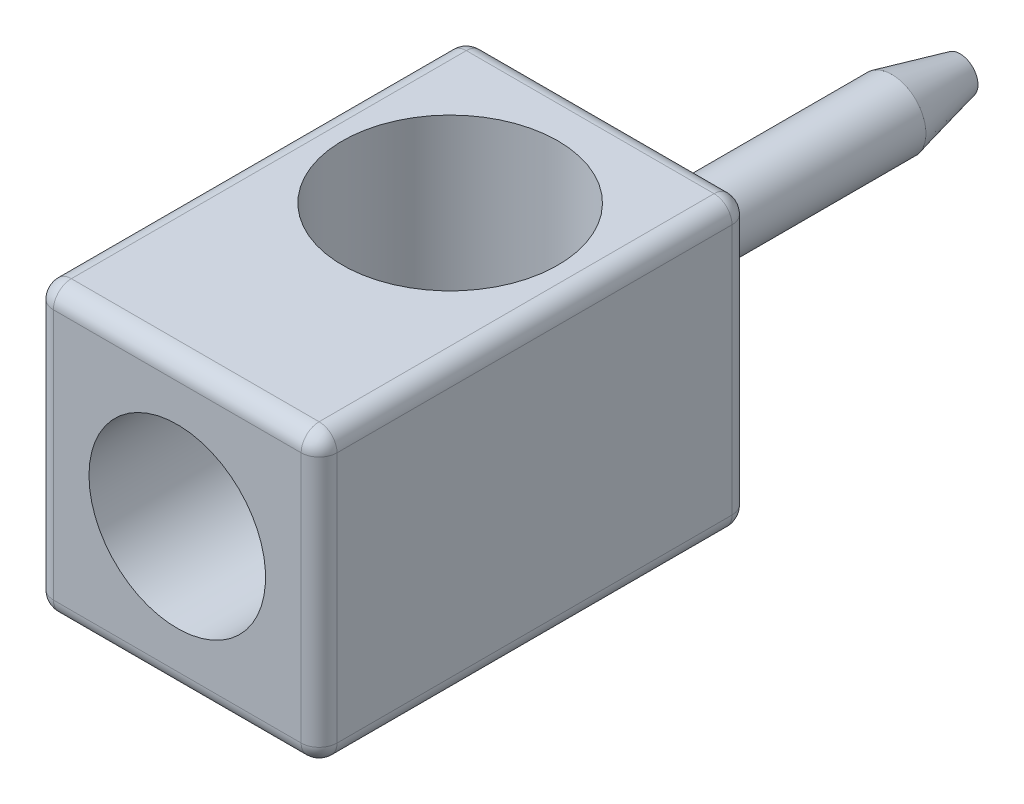
ISO-10303-21;
HEADER;
FILE_DESCRIPTION(('STEP AP214'),'2;1');
FILE_NAME('part.step','',(''),(''),'','','');
FILE_SCHEMA(('AUTOMOTIVE_DESIGN { 1 0 10303 214 1 1 1 1 }'));
ENDSEC;
DATA;
#1=APPLICATION_CONTEXT('core data for automotive mechanical design processes');
#2=APPLICATION_PROTOCOL_DEFINITION('international standard','automotive_design',2000,#1);
#3=PRODUCT_CONTEXT('',#1,'mechanical');
#4=PRODUCT('Part','Part','',(#3));
#5=PRODUCT_RELATED_PRODUCT_CATEGORY('part','',(#4));
#6=PRODUCT_DEFINITION_FORMATION('','',#4);
#7=PRODUCT_DEFINITION_CONTEXT('part definition',#1,'design');
#8=PRODUCT_DEFINITION('design','',#6,#7);
#9=PRODUCT_DEFINITION_SHAPE('','',#8);
#10=(LENGTH_UNIT() NAMED_UNIT(*) SI_UNIT(.MILLI.,.METRE.));
#11=(NAMED_UNIT(*) PLANE_ANGLE_UNIT() SI_UNIT($,.RADIAN.));
#12=(NAMED_UNIT(*) SI_UNIT($,.STERADIAN.) SOLID_ANGLE_UNIT());
#13=UNCERTAINTY_MEASURE_WITH_UNIT(LENGTH_MEASURE(1.E-05),#10,'distance_accuracy_value','');
#14=(GEOMETRIC_REPRESENTATION_CONTEXT(3) GLOBAL_UNCERTAINTY_ASSIGNED_CONTEXT((#13)) GLOBAL_UNIT_ASSIGNED_CONTEXT((#10,
#11,#12)) REPRESENTATION_CONTEXT('',''));
#15=CARTESIAN_POINT('',(0.,0.,0.));
#16=DIRECTION('',(0.,0.,1.));
#17=DIRECTION('',(1.,0.,0.));
#18=AXIS2_PLACEMENT_3D('',#15,#16,#17);
#19=CARTESIAN_POINT('',(0.,0.,-7.9));
#20=DIRECTION('',(0.,0.,1.));
#21=DIRECTION('',(1.,0.,0.));
#22=AXIS2_PLACEMENT_3D('',#19,#20,#21);
#23=PLANE('',#22);
#24=CARTESIAN_POINT('',(0.,0.,-7.90000000000646));
#25=DIRECTION('',(0.,0.,1.));
#26=DIRECTION('',(1.,0.,0.));
#27=AXIS2_PLACEMENT_3D('',#24,#25,#26);
#28=CIRCLE('',#27,0.249999999979877);
#29=CARTESIAN_POINT('',(0.249999999979877,0.,-7.90000000000646));
#30=VERTEX_POINT('',#29);
#31=EDGE_CURVE('E20',#30,#30,#28,.T.);
#32=ORIENTED_EDGE('',*,*,#31,.F.);
#33=EDGE_LOOP('',(#32));
#34=FACE_BOUND('',#33,.T.);
#35=ADVANCED_FACE('F17',(#34),#23,.F.);
#36=CARTESIAN_POINT('',(0.,0.,-6.94999999996071));
#37=DIRECTION('',(0.,0.,1.));
#38=DIRECTION('',(1.,0.,0.));
#39=AXIS2_PLACEMENT_3D('',#36,#37,#38);
#40=CONICAL_SURFACE('',#39,0.474999999994452,0.232556941808636);
#41=CARTESIAN_POINT('',(0.,0.,-6.95));
#42=DIRECTION('',(0.,0.,-1.));
#43=DIRECTION('',(-1.,0.,0.));
#44=AXIS2_PLACEMENT_3D('',#41,#42,#43);
#45=CIRCLE('',#44,0.475);
#46=CARTESIAN_POINT('',(-0.475000000000001,0.,-6.95));
#47=VERTEX_POINT('',#46);
#48=EDGE_CURVE('E217',#47,#47,#45,.F.);
#49=ORIENTED_EDGE('',*,*,#48,.F.);
#50=EDGE_LOOP('',(#49));
#51=FACE_BOUND('',#50,.T.);
#52=ORIENTED_EDGE('',*,*,#31,.T.);
#53=EDGE_LOOP('',(#52));
#54=FACE_BOUND('',#53,.T.);
#55=ADVANCED_FACE('F235',(#51,#54),#40,.T.);
#56=CARTESIAN_POINT('',(0.,0.,-7.9));
#57=DIRECTION('',(0.,0.,-1.));
#58=DIRECTION('',(-1.,0.,0.));
#59=AXIS2_PLACEMENT_3D('',#56,#57,#58);
#60=CYLINDRICAL_SURFACE('',#59,0.475);
#61=CARTESIAN_POINT('',(0.,0.,-3.));
#62=DIRECTION('',(0.,0.,-1.));
#63=DIRECTION('',(-1.,0.,0.));
#64=AXIS2_PLACEMENT_3D('',#61,#62,#63);
#65=CIRCLE('',#64,0.475);
#66=CARTESIAN_POINT('',(-0.475000000000001,0.,-3.));
#67=VERTEX_POINT('',#66);
#68=EDGE_CURVE('E195',#67,#67,#65,.T.);
#69=ORIENTED_EDGE('',*,*,#68,.T.);
#70=EDGE_LOOP('',(#69));
#71=FACE_BOUND('',#70,.T.);
#72=ORIENTED_EDGE('',*,*,#48,.T.);
#73=EDGE_LOOP('',(#72));
#74=FACE_BOUND('',#73,.T.);
#75=ADVANCED_FACE('F232',(#71,#74),#60,.T.);
#76=CARTESIAN_POINT('',(1.725,-2.,-2.75));
#77=DIRECTION('',(0.,-1.,0.));
#78=DIRECTION('',(0.,0.,-1.));
#79=AXIS2_PLACEMENT_3D('',#76,#77,#78);
#80=CYLINDRICAL_SURFACE('',#79,0.25);
#81=CARTESIAN_POINT('',(1.725,1.75,-2.75));
#82=DIRECTION('',(0.,1.,-6.13305568504924E-12));
#83=DIRECTION('',(1.,0.,0.));
#84=AXIS2_PLACEMENT_3D('',#81,#82,#83);
#85=CIRCLE('',#84,0.25);
#86=CARTESIAN_POINT('',(1.975,1.75,-2.75));
#87=VERTEX_POINT('',#86);
#88=CARTESIAN_POINT('',(1.725,1.74999999999962,-3.));
#89=VERTEX_POINT('',#88);
#90=EDGE_CURVE('E216',#87,#89,#85,.T.);
#91=ORIENTED_EDGE('',*,*,#90,.F.);
#92=DIRECTION('',(0.,1.,0.));
#93=VECTOR('',#92,1.);
#94=CARTESIAN_POINT('',(1.975,-2.,-2.75));
#95=LINE('',#94,#93);
#96=CARTESIAN_POINT('',(1.975,-1.75,-2.75));
#97=VERTEX_POINT('',#96);
#98=EDGE_CURVE('E105',#87,#97,#95,.F.);
#99=ORIENTED_EDGE('',*,*,#98,.T.);
#100=CARTESIAN_POINT('',(1.725,-1.75,-2.75));
#101=DIRECTION('',(0.,1.,0.));
#102=DIRECTION('',(1.,0.,0.));
#103=AXIS2_PLACEMENT_3D('',#100,#101,#102);
#104=CIRCLE('',#103,0.25);
#105=CARTESIAN_POINT('',(1.725,-1.75,-3.));
#106=VERTEX_POINT('',#105);
#107=EDGE_CURVE('E193',#106,#97,#104,.F.);
#108=ORIENTED_EDGE('',*,*,#107,.F.);
#109=DIRECTION('',(0.,1.,0.));
#110=VECTOR('',#109,1.);
#111=CARTESIAN_POINT('',(1.725,-2.,-3.));
#112=LINE('',#111,#110);
#113=EDGE_CURVE('E192',#106,#89,#112,.T.);
#114=ORIENTED_EDGE('',*,*,#113,.T.);
#115=EDGE_LOOP('',(#91,#99,#108,#114));
#116=FACE_BOUND('',#115,.T.);
#117=ADVANCED_FACE('F228',(#116),#80,.T.);
#118=CARTESIAN_POINT('',(-1.725,2.,-2.75));
#119=DIRECTION('',(0.,1.,0.));
#120=DIRECTION('',(0.,0.,1.));
#121=AXIS2_PLACEMENT_3D('',#118,#119,#120);
#122=CYLINDRICAL_SURFACE('',#121,0.25);
#123=CARTESIAN_POINT('',(-1.725,1.75,-2.75));
#124=DIRECTION('',(0.,1.,0.));
#125=DIRECTION('',(1.,0.,0.));
#126=AXIS2_PLACEMENT_3D('',#123,#124,#125);
#127=CIRCLE('',#126,0.25);
#128=CARTESIAN_POINT('',(-1.725,1.75,-3.));
#129=VERTEX_POINT('',#128);
#130=CARTESIAN_POINT('',(-1.975,1.75,-2.75));
#131=VERTEX_POINT('',#130);
#132=EDGE_CURVE('E123',#129,#131,#127,.T.);
#133=ORIENTED_EDGE('',*,*,#132,.F.);
#134=DIRECTION('',(0.,1.,0.));
#135=VECTOR('',#134,1.);
#136=CARTESIAN_POINT('',(-1.725,-2.,-3.));
#137=LINE('',#136,#135);
#138=CARTESIAN_POINT('',(-1.725,-1.75000000000038,-3.));
#139=VERTEX_POINT('',#138);
#140=EDGE_CURVE('E422',#129,#139,#137,.F.);
#141=ORIENTED_EDGE('',*,*,#140,.T.);
#142=CARTESIAN_POINT('',(-1.725,-1.75,-2.75));
#143=DIRECTION('',(0.,1.,-6.13305568504924E-12));
#144=DIRECTION('',(1.,0.,0.));
#145=AXIS2_PLACEMENT_3D('',#142,#143,#144);
#146=CIRCLE('',#145,0.25);
#147=CARTESIAN_POINT('',(-1.975,-1.75,-2.75));
#148=VERTEX_POINT('',#147);
#149=EDGE_CURVE('E171',#148,#139,#146,.F.);
#150=ORIENTED_EDGE('',*,*,#149,.F.);
#151=DIRECTION('',(0.,1.,0.));
#152=VECTOR('',#151,1.);
#153=CARTESIAN_POINT('',(-1.975,2.,-2.75));
#154=LINE('',#153,#152);
#155=EDGE_CURVE('E168',#148,#131,#154,.T.);
#156=ORIENTED_EDGE('',*,*,#155,.T.);
#157=EDGE_LOOP('',(#133,#141,#150,#156));
#158=FACE_BOUND('',#157,.T.);
#159=ADVANCED_FACE('F225',(#158),#122,.T.);
#160=CARTESIAN_POINT('',(1.725,1.75,2.75));
#161=DIRECTION('',(1.,0.,0.));
#162=DIRECTION('',(0.,1.,0.));
#163=AXIS2_PLACEMENT_3D('',#160,#161,#162);
#164=SPHERICAL_SURFACE('',#163,0.25);
#165=CARTESIAN_POINT('',(1.725,1.75,2.75));
#166=DIRECTION('',(0.,0.,1.));
#167=DIRECTION('',(1.,0.,0.));
#168=AXIS2_PLACEMENT_3D('',#165,#166,#167);
#169=CIRCLE('',#168,0.25);
#170=CARTESIAN_POINT('',(1.725,2.,2.75));
#171=VERTEX_POINT('',#170);
#172=CARTESIAN_POINT('',(1.975,1.75,2.75));
#173=VERTEX_POINT('',#172);
#174=EDGE_CURVE('E114',#171,#173,#169,.F.);
#175=ORIENTED_EDGE('',*,*,#174,.F.);
#176=CARTESIAN_POINT('',(1.725,1.75,2.75));
#177=DIRECTION('',(-1.,0.,0.));
#178=DIRECTION('',(0.,0.,1.));
#179=AXIS2_PLACEMENT_3D('',#176,#177,#178);
#180=CIRCLE('',#179,0.25);
#181=CARTESIAN_POINT('',(1.725,1.75,3.));
#182=VERTEX_POINT('',#181);
#183=EDGE_CURVE('E116',#182,#171,#180,.T.);
#184=ORIENTED_EDGE('',*,*,#183,.F.);
#185=CARTESIAN_POINT('',(1.725,1.75,2.75));
#186=DIRECTION('',(0.,1.,0.));
#187=DIRECTION('',(0.,0.,1.));
#188=AXIS2_PLACEMENT_3D('',#185,#186,#187);
#189=CIRCLE('',#188,0.25);
#190=EDGE_CURVE('E111',#173,#182,#189,.F.);
#191=ORIENTED_EDGE('',*,*,#190,.F.);
#192=EDGE_LOOP('',(#175,#184,#191));
#193=FACE_BOUND('',#192,.T.);
#194=ADVANCED_FACE('F113',(#193),#164,.T.);
#195=CARTESIAN_POINT('',(-1.725,1.75,2.75));
#196=DIRECTION('',(1.,0.,0.));
#197=DIRECTION('',(0.,1.,0.));
#198=AXIS2_PLACEMENT_3D('',#195,#196,#197);
#199=SPHERICAL_SURFACE('',#198,0.25);
#200=CARTESIAN_POINT('',(-1.725,1.75,2.75));
#201=DIRECTION('',(-1.,0.,0.));
#202=DIRECTION('',(0.,0.,1.));
#203=AXIS2_PLACEMENT_3D('',#200,#201,#202);
#204=CIRCLE('',#203,0.25);
#205=CARTESIAN_POINT('',(-1.725,2.,2.75));
#206=VERTEX_POINT('',#205);
#207=CARTESIAN_POINT('',(-1.725,1.75000000000077,3.));
#208=VERTEX_POINT('',#207);
#209=EDGE_CURVE('E313',#206,#208,#204,.F.);
#210=ORIENTED_EDGE('',*,*,#209,.F.);
#211=CARTESIAN_POINT('',(-1.725,1.75,2.75));
#212=DIRECTION('',(0.,0.,1.));
#213=DIRECTION('',(1.,0.,0.));
#214=AXIS2_PLACEMENT_3D('',#211,#212,#213);
#215=CIRCLE('',#214,0.25);
#216=CARTESIAN_POINT('',(-1.975,1.75,2.75));
#217=VERTEX_POINT('',#216);
#218=EDGE_CURVE('E321',#217,#206,#215,.F.);
#219=ORIENTED_EDGE('',*,*,#218,.F.);
#220=CARTESIAN_POINT('',(-1.725,1.75,2.75));
#221=DIRECTION('',(0.,-1.,0.));
#222=DIRECTION('',(0.,0.,-1.));
#223=AXIS2_PLACEMENT_3D('',#220,#221,#222);
#224=CIRCLE('',#223,0.25);
#225=EDGE_CURVE('E122',#208,#217,#224,.T.);
#226=ORIENTED_EDGE('',*,*,#225,.F.);
#227=EDGE_LOOP('',(#210,#219,#226));
#228=FACE_BOUND('',#227,.T.);
#229=ADVANCED_FACE('F210',(#228),#199,.T.);
#230=CARTESIAN_POINT('',(1.725,1.75,-2.75));
#231=DIRECTION('',(1.,0.,0.));
#232=DIRECTION('',(0.,1.,0.));
#233=AXIS2_PLACEMENT_3D('',#230,#231,#232);
#234=SPHERICAL_SURFACE('',#233,0.25);
#235=ORIENTED_EDGE('',*,*,#90,.T.);
#236=CARTESIAN_POINT('',(1.725,1.75,-2.75));
#237=DIRECTION('',(1.,0.,0.));
#238=DIRECTION('',(0.,0.,-1.));
#239=AXIS2_PLACEMENT_3D('',#236,#237,#238);
#240=CIRCLE('',#239,0.25);
#241=CARTESIAN_POINT('',(1.725,2.,-2.75));
#242=VERTEX_POINT('',#241);
#243=EDGE_CURVE('E345',#242,#89,#240,.F.);
#244=ORIENTED_EDGE('',*,*,#243,.F.);
#245=CARTESIAN_POINT('',(1.725,1.75,-2.75));
#246=DIRECTION('',(0.,0.,1.));
#247=DIRECTION('',(1.,0.,0.));
#248=AXIS2_PLACEMENT_3D('',#245,#246,#247);
#249=CIRCLE('',#248,0.25);
#250=EDGE_CURVE('E141',#87,#242,#249,.T.);
#251=ORIENTED_EDGE('',*,*,#250,.F.);
#252=EDGE_LOOP('',(#235,#244,#251));
#253=FACE_BOUND('',#252,.T.);
#254=ADVANCED_FACE('F206',(#253),#234,.T.);
#255=CARTESIAN_POINT('',(-1.725,1.75,-2.75));
#256=DIRECTION('',(1.,0.,0.));
#257=DIRECTION('',(0.,1.,0.));
#258=AXIS2_PLACEMENT_3D('',#255,#256,#257);
#259=SPHERICAL_SURFACE('',#258,0.25);
#260=ORIENTED_EDGE('',*,*,#132,.T.);
#261=CARTESIAN_POINT('',(-1.725,1.75,-2.75));
#262=DIRECTION('',(0.,0.,1.));
#263=DIRECTION('',(1.,0.,0.));
#264=AXIS2_PLACEMENT_3D('',#261,#262,#263);
#265=CIRCLE('',#264,0.25);
#266=CARTESIAN_POINT('',(-1.725,2.,-2.75));
#267=VERTEX_POINT('',#266);
#268=EDGE_CURVE('E351',#267,#131,#265,.T.);
#269=ORIENTED_EDGE('',*,*,#268,.F.);
#270=CARTESIAN_POINT('',(-1.725,1.75,-2.75));
#271=DIRECTION('',(1.,0.,0.));
#272=DIRECTION('',(0.,0.,-1.));
#273=AXIS2_PLACEMENT_3D('',#270,#271,#272);
#274=CIRCLE('',#273,0.25);
#275=EDGE_CURVE('E340',#129,#267,#274,.T.);
#276=ORIENTED_EDGE('',*,*,#275,.F.);
#277=EDGE_LOOP('',(#260,#269,#276));
#278=FACE_BOUND('',#277,.T.);
#279=ADVANCED_FACE('F202',(#278),#259,.T.);
#280=CARTESIAN_POINT('',(1.725,-2.,2.75));
#281=DIRECTION('',(0.,1.,0.));
#282=DIRECTION('',(0.,0.,1.));
#283=AXIS2_PLACEMENT_3D('',#280,#281,#282);
#284=CYLINDRICAL_SURFACE('',#283,0.25);
#285=ORIENTED_EDGE('',*,*,#190,.T.);
#286=DIRECTION('',(0.,1.,0.));
#287=VECTOR('',#286,1.);
#288=CARTESIAN_POINT('',(1.725,-2.,3.));
#289=LINE('',#288,#287);
#290=CARTESIAN_POINT('',(1.725,-1.74999999999962,3.));
#291=VERTEX_POINT('',#290);
#292=EDGE_CURVE('E327',#291,#182,#289,.T.);
#293=ORIENTED_EDGE('',*,*,#292,.F.);
#294=CARTESIAN_POINT('',(1.725,-1.75,2.75));
#295=DIRECTION('',(0.,-1.,6.13293322036932E-12));
#296=DIRECTION('',(1.,0.,0.));
#297=AXIS2_PLACEMENT_3D('',#294,#295,#296);
#298=CIRCLE('',#297,0.25);
#299=CARTESIAN_POINT('',(1.975,-1.75,2.75));
#300=VERTEX_POINT('',#299);
#301=EDGE_CURVE('E137',#300,#291,#298,.T.);
#302=ORIENTED_EDGE('',*,*,#301,.F.);
#303=DIRECTION('',(0.,1.,0.));
#304=VECTOR('',#303,1.);
#305=CARTESIAN_POINT('',(1.975,-2.,2.75));
#306=LINE('',#305,#304);
#307=EDGE_CURVE('E135',#300,#173,#306,.T.);
#308=ORIENTED_EDGE('',*,*,#307,.T.);
#309=EDGE_LOOP('',(#285,#293,#302,#308));
#310=FACE_BOUND('',#309,.T.);
#311=ADVANCED_FACE('F136',(#310),#284,.T.);
#312=CARTESIAN_POINT('',(-1.725,-2.,2.75));
#313=DIRECTION('',(0.,-1.,0.));
#314=DIRECTION('',(0.,0.,-1.));
#315=AXIS2_PLACEMENT_3D('',#312,#313,#314);
#316=CYLINDRICAL_SURFACE('',#315,0.25);
#317=ORIENTED_EDGE('',*,*,#225,.T.);
#318=DIRECTION('',(0.,1.,0.));
#319=VECTOR('',#318,1.);
#320=CARTESIAN_POINT('',(-1.975,2.,2.75));
#321=LINE('',#320,#319);
#322=CARTESIAN_POINT('',(-1.975,-1.75,2.75));
#323=VERTEX_POINT('',#322);
#324=EDGE_CURVE('E165',#217,#323,#321,.F.);
#325=ORIENTED_EDGE('',*,*,#324,.T.);
#326=CARTESIAN_POINT('',(-1.725,-1.75,2.75));
#327=DIRECTION('',(0.,-1.,0.));
#328=DIRECTION('',(1.,0.,0.));
#329=AXIS2_PLACEMENT_3D('',#326,#327,#328);
#330=CIRCLE('',#329,0.25);
#331=CARTESIAN_POINT('',(-1.725,-1.75,3.));
#332=VERTEX_POINT('',#331);
#333=EDGE_CURVE('E132',#332,#323,#330,.T.);
#334=ORIENTED_EDGE('',*,*,#333,.F.);
#335=DIRECTION('',(0.,1.,0.));
#336=VECTOR('',#335,1.);
#337=CARTESIAN_POINT('',(-1.725,-2.,3.));
#338=LINE('',#337,#336);
#339=EDGE_CURVE('E326',#208,#332,#338,.F.);
#340=ORIENTED_EDGE('',*,*,#339,.F.);
#341=EDGE_LOOP('',(#317,#325,#334,#340));
#342=FACE_BOUND('',#341,.T.);
#343=ADVANCED_FACE('F332',(#342),#316,.T.);
#344=CARTESIAN_POINT('',(1.975,-2.,3.));
#345=DIRECTION('',(-1.,0.,0.));
#346=DIRECTION('',(0.,0.,1.));
#347=AXIS2_PLACEMENT_3D('',#344,#345,#346);
#348=PLANE('',#347);
#349=DIRECTION('',(0.,0.,1.));
#350=VECTOR('',#349,1.);
#351=CARTESIAN_POINT('',(1.975,1.75,3.));
#352=LINE('',#351,#350);
#353=EDGE_CURVE('E128',#173,#87,#352,.F.);
#354=ORIENTED_EDGE('',*,*,#353,.F.);
#355=ORIENTED_EDGE('',*,*,#307,.F.);
#356=DIRECTION('',(0.,0.,1.));
#357=VECTOR('',#356,1.);
#358=CARTESIAN_POINT('',(1.975,-1.75,3.));
#359=LINE('',#358,#357);
#360=EDGE_CURVE('E384',#97,#300,#359,.T.);
#361=ORIENTED_EDGE('',*,*,#360,.F.);
#362=ORIENTED_EDGE('',*,*,#98,.F.);
#363=EDGE_LOOP('',(#354,#355,#361,#362));
#364=FACE_BOUND('',#363,.T.);
#365=ADVANCED_FACE('F140',(#364),#348,.F.);
#366=CARTESIAN_POINT('',(1.725,-1.75,-2.75));
#367=DIRECTION('',(1.,0.,0.));
#368=DIRECTION('',(0.,1.,0.));
#369=AXIS2_PLACEMENT_3D('',#366,#367,#368);
#370=SPHERICAL_SURFACE('',#369,0.25);
#371=CARTESIAN_POINT('',(1.725,-1.75,-2.75));
#372=DIRECTION('',(0.,0.,1.));
#373=DIRECTION('',(1.,0.,0.));
#374=AXIS2_PLACEMENT_3D('',#371,#372,#373);
#375=CIRCLE('',#374,0.25);
#376=CARTESIAN_POINT('',(1.725,-2.,-2.74999999999847));
#377=VERTEX_POINT('',#376);
#378=EDGE_CURVE('E335',#377,#97,#375,.T.);
#379=ORIENTED_EDGE('',*,*,#378,.F.);
#380=CARTESIAN_POINT('',(1.725,-1.75,-2.75));
#381=DIRECTION('',(-1.,0.,0.));
#382=DIRECTION('',(0.,0.,1.));
#383=AXIS2_PLACEMENT_3D('',#380,#381,#382);
#384=CIRCLE('',#383,0.25);
#385=EDGE_CURVE('E382',#106,#377,#384,.T.);
#386=ORIENTED_EDGE('',*,*,#385,.F.);
#387=ORIENTED_EDGE('',*,*,#107,.T.);
#388=EDGE_LOOP('',(#379,#386,#387));
#389=FACE_BOUND('',#388,.T.);
#390=ADVANCED_FACE('F182',(#389),#370,.T.);
#391=CARTESIAN_POINT('',(-1.975,-2.,-3.));
#392=DIRECTION('',(0.,0.,1.));
#393=DIRECTION('',(1.,0.,0.));
#394=AXIS2_PLACEMENT_3D('',#391,#392,#393);
#395=PLANE('',#394);
#396=DIRECTION('',(1.,0.,0.));
#397=VECTOR('',#396,1.);
#398=CARTESIAN_POINT('',(1.975,1.75,-3.));
#399=LINE('',#398,#397);
#400=EDGE_CURVE('E342',#89,#129,#399,.F.);
#401=ORIENTED_EDGE('',*,*,#400,.F.);
#402=ORIENTED_EDGE('',*,*,#113,.F.);
#403=DIRECTION('',(-1.,0.,0.));
#404=VECTOR('',#403,1.);
#405=CARTESIAN_POINT('',(-1.975,-1.75,-3.));
#406=LINE('',#405,#404);
#407=EDGE_CURVE('E376',#139,#106,#406,.F.);
#408=ORIENTED_EDGE('',*,*,#407,.F.);
#409=ORIENTED_EDGE('',*,*,#140,.F.);
#410=EDGE_LOOP('',(#401,#402,#408,#409));
#411=FACE_BOUND('',#410,.T.);
#412=ORIENTED_EDGE('',*,*,#68,.F.);
#413=EDGE_LOOP('',(#412));
#414=FACE_BOUND('',#413,.T.);
#415=ADVANCED_FACE('F178',(#411,#414),#395,.F.);
#416=CARTESIAN_POINT('',(-1.725,-1.75,-2.75));
#417=DIRECTION('',(1.,0.,0.));
#418=DIRECTION('',(0.,1.,0.));
#419=AXIS2_PLACEMENT_3D('',#416,#417,#418);
#420=SPHERICAL_SURFACE('',#419,0.25);
#421=CARTESIAN_POINT('',(-1.725,-1.75,-2.75));
#422=DIRECTION('',(0.,0.,1.));
#423=DIRECTION('',(1.,0.,0.));
#424=AXIS2_PLACEMENT_3D('',#421,#422,#423);
#425=CIRCLE('',#424,0.25);
#426=CARTESIAN_POINT('',(-1.725,-2.,-2.75));
#427=VERTEX_POINT('',#426);
#428=EDGE_CURVE('E371',#148,#427,#425,.T.);
#429=ORIENTED_EDGE('',*,*,#428,.F.);
#430=ORIENTED_EDGE('',*,*,#149,.T.);
#431=CARTESIAN_POINT('',(-1.725,-1.75,-2.75));
#432=DIRECTION('',(-1.,0.,0.));
#433=DIRECTION('',(0.,0.,1.));
#434=AXIS2_PLACEMENT_3D('',#431,#432,#433);
#435=CIRCLE('',#434,0.25);
#436=EDGE_CURVE('E379',#427,#139,#435,.F.);
#437=ORIENTED_EDGE('',*,*,#436,.F.);
#438=EDGE_LOOP('',(#429,#430,#437));
#439=FACE_BOUND('',#438,.T.);
#440=ADVANCED_FACE('F175',(#439),#420,.T.);
#441=CARTESIAN_POINT('',(-1.975,2.,3.));
#442=DIRECTION('',(1.,0.,0.));
#443=DIRECTION('',(0.,0.,-1.));
#444=AXIS2_PLACEMENT_3D('',#441,#442,#443);
#445=PLANE('',#444);
#446=DIRECTION('',(0.,0.,1.));
#447=VECTOR('',#446,1.);
#448=CARTESIAN_POINT('',(-1.975,1.75,3.));
#449=LINE('',#448,#447);
#450=EDGE_CURVE('E348',#131,#217,#449,.T.);
#451=ORIENTED_EDGE('',*,*,#450,.F.);
#452=ORIENTED_EDGE('',*,*,#155,.F.);
#453=DIRECTION('',(0.,0.,1.));
#454=VECTOR('',#453,1.);
#455=CARTESIAN_POINT('',(-1.975,-1.75,3.));
#456=LINE('',#455,#454);
#457=EDGE_CURVE('E362',#323,#148,#456,.F.);
#458=ORIENTED_EDGE('',*,*,#457,.F.);
#459=ORIENTED_EDGE('',*,*,#324,.F.);
#460=EDGE_LOOP('',(#451,#452,#458,#459));
#461=FACE_BOUND('',#460,.T.);
#462=ADVANCED_FACE('F159',(#461),#445,.F.);
#463=CARTESIAN_POINT('',(1.725,-1.75,2.75));
#464=DIRECTION('',(1.,0.,0.));
#465=DIRECTION('',(0.,1.,0.));
#466=AXIS2_PLACEMENT_3D('',#463,#464,#465);
#467=SPHERICAL_SURFACE('',#466,0.25);
#468=CARTESIAN_POINT('',(1.725,-1.75,2.75));
#469=DIRECTION('',(0.,0.,1.));
#470=DIRECTION('',(1.,0.,0.));
#471=AXIS2_PLACEMENT_3D('',#468,#469,#470);
#472=CIRCLE('',#471,0.25);
#473=CARTESIAN_POINT('',(1.725,-2.,2.75));
#474=VERTEX_POINT('',#473);
#475=EDGE_CURVE('E333',#300,#474,#472,.F.);
#476=ORIENTED_EDGE('',*,*,#475,.F.);
#477=ORIENTED_EDGE('',*,*,#301,.T.);
#478=CARTESIAN_POINT('',(1.725,-1.75,2.75));
#479=DIRECTION('',(1.,0.,0.));
#480=DIRECTION('',(0.,0.,-1.));
#481=AXIS2_PLACEMENT_3D('',#478,#479,#480);
#482=CIRCLE('',#481,0.25);
#483=EDGE_CURVE('E365',#474,#291,#482,.F.);
#484=ORIENTED_EDGE('',*,*,#483,.F.);
#485=EDGE_LOOP('',(#476,#477,#484));
#486=FACE_BOUND('',#485,.T.);
#487=ADVANCED_FACE('F154',(#486),#467,.T.);
#488=CARTESIAN_POINT('',(-1.725,-1.75,2.75));
#489=DIRECTION('',(1.,0.,0.));
#490=DIRECTION('',(0.,1.,0.));
#491=AXIS2_PLACEMENT_3D('',#488,#489,#490);
#492=SPHERICAL_SURFACE('',#491,0.25);
#493=CARTESIAN_POINT('',(-1.725,-1.75,2.75));
#494=DIRECTION('',(1.,0.,0.));
#495=DIRECTION('',(0.,0.,-1.));
#496=AXIS2_PLACEMENT_3D('',#493,#494,#495);
#497=CIRCLE('',#496,0.25);
#498=CARTESIAN_POINT('',(-1.725,-2.,2.74999999999847));
#499=VERTEX_POINT('',#498);
#500=EDGE_CURVE('E35',#332,#499,#497,.T.);
#501=ORIENTED_EDGE('',*,*,#500,.F.);
#502=ORIENTED_EDGE('',*,*,#333,.T.);
#503=CARTESIAN_POINT('',(-1.725,-1.75,2.75));
#504=DIRECTION('',(0.,0.,1.));
#505=DIRECTION('',(1.,0.,0.));
#506=AXIS2_PLACEMENT_3D('',#503,#504,#505);
#507=CIRCLE('',#506,0.25);
#508=EDGE_CURVE('E366',#499,#323,#507,.F.);
#509=ORIENTED_EDGE('',*,*,#508,.F.);
#510=EDGE_LOOP('',(#501,#502,#509));
#511=FACE_BOUND('',#510,.T.);
#512=ADVANCED_FACE('F150',(#511),#492,.T.);
#513=CARTESIAN_POINT('',(1.725,1.75,3.));
#514=DIRECTION('',(0.,0.,1.));
#515=DIRECTION('',(1.,0.,0.));
#516=AXIS2_PLACEMENT_3D('',#513,#514,#515);
#517=CYLINDRICAL_SURFACE('',#516,0.25);
#518=ORIENTED_EDGE('',*,*,#250,.T.);
#519=DIRECTION('',(0.,0.,-1.));
#520=VECTOR('',#519,1.);
#521=CARTESIAN_POINT('',(1.725,2.,3.));
#522=LINE('',#521,#520);
#523=EDGE_CURVE('E131',#242,#171,#522,.F.);
#524=ORIENTED_EDGE('',*,*,#523,.T.);
#525=ORIENTED_EDGE('',*,*,#174,.T.);
#526=ORIENTED_EDGE('',*,*,#353,.T.);
#527=EDGE_LOOP('',(#518,#524,#525,#526));
#528=FACE_BOUND('',#527,.T.);
#529=ADVANCED_FACE('F127',(#528),#517,.T.);
#530=CARTESIAN_POINT('',(-1.975,1.75,2.75));
#531=DIRECTION('',(-1.,0.,0.));
#532=DIRECTION('',(0.,0.,1.));
#533=AXIS2_PLACEMENT_3D('',#530,#531,#532);
#534=CYLINDRICAL_SURFACE('',#533,0.25);
#535=ORIENTED_EDGE('',*,*,#209,.T.);
#536=DIRECTION('',(1.,0.,0.));
#537=VECTOR('',#536,1.);
#538=CARTESIAN_POINT('',(-1.975,1.75,3.));
#539=LINE('',#538,#537);
#540=EDGE_CURVE('E315',#182,#208,#539,.F.);
#541=ORIENTED_EDGE('',*,*,#540,.F.);
#542=ORIENTED_EDGE('',*,*,#183,.T.);
#543=DIRECTION('',(1.,0.,0.));
#544=VECTOR('',#543,1.);
#545=CARTESIAN_POINT('',(1.975,2.,2.75));
#546=LINE('',#545,#544);
#547=EDGE_CURVE('E316',#171,#206,#546,.F.);
#548=ORIENTED_EDGE('',*,*,#547,.T.);
#549=EDGE_LOOP('',(#535,#541,#542,#548));
#550=FACE_BOUND('',#549,.T.);
#551=ADVANCED_FACE('F304',(#550),#534,.T.);
#552=CARTESIAN_POINT('',(-1.725,1.75,3.));
#553=DIRECTION('',(0.,0.,1.));
#554=DIRECTION('',(1.,0.,0.));
#555=AXIS2_PLACEMENT_3D('',#552,#553,#554);
#556=CYLINDRICAL_SURFACE('',#555,0.25);
#557=ORIENTED_EDGE('',*,*,#268,.T.);
#558=ORIENTED_EDGE('',*,*,#450,.T.);
#559=ORIENTED_EDGE('',*,*,#218,.T.);
#560=DIRECTION('',(0.,0.,-1.));
#561=VECTOR('',#560,1.);
#562=CARTESIAN_POINT('',(-1.725,2.,3.));
#563=LINE('',#562,#561);
#564=EDGE_CURVE('E355',#206,#267,#563,.T.);
#565=ORIENTED_EDGE('',*,*,#564,.T.);
#566=EDGE_LOOP('',(#557,#558,#559,#565));
#567=FACE_BOUND('',#566,.T.);
#568=ADVANCED_FACE('F301',(#567),#556,.T.);
#569=CARTESIAN_POINT('',(1.975,1.75,-2.75));
#570=DIRECTION('',(1.,0.,0.));
#571=DIRECTION('',(0.,0.,-1.));
#572=AXIS2_PLACEMENT_3D('',#569,#570,#571);
#573=CYLINDRICAL_SURFACE('',#572,0.25);
#574=ORIENTED_EDGE('',*,*,#275,.T.);
#575=DIRECTION('',(1.,0.,0.));
#576=VECTOR('',#575,1.);
#577=CARTESIAN_POINT('',(1.975,2.,-2.75));
#578=LINE('',#577,#576);
#579=EDGE_CURVE('E401',#267,#242,#578,.T.);
#580=ORIENTED_EDGE('',*,*,#579,.T.);
#581=ORIENTED_EDGE('',*,*,#243,.T.);
#582=ORIENTED_EDGE('',*,*,#400,.T.);
#583=EDGE_LOOP('',(#574,#580,#581,#582));
#584=FACE_BOUND('',#583,.T.);
#585=ADVANCED_FACE('F297',(#584),#573,.T.);
#586=CARTESIAN_POINT('',(-1.975,-2.,3.));
#587=DIRECTION('',(0.,0.,1.));
#588=DIRECTION('',(1.,0.,0.));
#589=AXIS2_PLACEMENT_3D('',#586,#587,#588);
#590=PLANE('',#589);
#591=CARTESIAN_POINT('',(0.,0.,3.));
#592=DIRECTION('',(0.,0.,-1.));
#593=DIRECTION('',(-1.,0.,0.));
#594=AXIS2_PLACEMENT_3D('',#591,#592,#593);
#595=CIRCLE('',#594,1.2295);
#596=CARTESIAN_POINT('',(-1.2295,0.,3.));
#597=VERTEX_POINT('',#596);
#598=EDGE_CURVE('E270',#597,#597,#595,.T.);
#599=ORIENTED_EDGE('',*,*,#598,.T.);
#600=EDGE_LOOP('',(#599));
#601=FACE_BOUND('',#600,.T.);
#602=ORIENTED_EDGE('',*,*,#339,.T.);
#603=DIRECTION('',(1.,0.,0.));
#604=VECTOR('',#603,1.);
#605=CARTESIAN_POINT('',(-1.975,-1.75,3.));
#606=LINE('',#605,#604);
#607=EDGE_CURVE('E369',#291,#332,#606,.F.);
#608=ORIENTED_EDGE('',*,*,#607,.F.);
#609=ORIENTED_EDGE('',*,*,#292,.T.);
#610=ORIENTED_EDGE('',*,*,#540,.T.);
#611=EDGE_LOOP('',(#602,#608,#609,#610));
#612=FACE_BOUND('',#611,.T.);
#613=ADVANCED_FACE('F293',(#601,#612),#590,.T.);
#614=CARTESIAN_POINT('',(1.725,-1.75,3.));
#615=DIRECTION('',(0.,0.,1.));
#616=DIRECTION('',(1.,0.,0.));
#617=AXIS2_PLACEMENT_3D('',#614,#615,#616);
#618=CYLINDRICAL_SURFACE('',#617,0.25);
#619=ORIENTED_EDGE('',*,*,#378,.T.);
#620=ORIENTED_EDGE('',*,*,#360,.T.);
#621=ORIENTED_EDGE('',*,*,#475,.T.);
#622=DIRECTION('',(0.,0.,1.));
#623=VECTOR('',#622,1.);
#624=CARTESIAN_POINT('',(1.725,-2.,3.));
#625=LINE('',#624,#623);
#626=EDGE_CURVE('E390',#474,#377,#625,.F.);
#627=ORIENTED_EDGE('',*,*,#626,.T.);
#628=EDGE_LOOP('',(#619,#620,#621,#627));
#629=FACE_BOUND('',#628,.T.);
#630=ADVANCED_FACE('F289',(#629),#618,.T.);
#631=CARTESIAN_POINT('',(-1.975,-1.75,-2.75));
#632=DIRECTION('',(-1.,0.,0.));
#633=DIRECTION('',(0.,0.,1.));
#634=AXIS2_PLACEMENT_3D('',#631,#632,#633);
#635=CYLINDRICAL_SURFACE('',#634,0.25);
#636=ORIENTED_EDGE('',*,*,#436,.T.);
#637=ORIENTED_EDGE('',*,*,#407,.T.);
#638=ORIENTED_EDGE('',*,*,#385,.T.);
#639=DIRECTION('',(1.,0.,0.));
#640=VECTOR('',#639,1.);
#641=CARTESIAN_POINT('',(-1.975,-2.,-2.75));
#642=LINE('',#641,#640);
#643=EDGE_CURVE('E412',#377,#427,#642,.F.);
#644=ORIENTED_EDGE('',*,*,#643,.T.);
#645=EDGE_LOOP('',(#636,#637,#638,#644));
#646=FACE_BOUND('',#645,.T.);
#647=ADVANCED_FACE('F285',(#646),#635,.T.);
#648=CARTESIAN_POINT('',(-1.725,-1.75,3.));
#649=DIRECTION('',(0.,0.,1.));
#650=DIRECTION('',(1.,0.,0.));
#651=AXIS2_PLACEMENT_3D('',#648,#649,#650);
#652=CYLINDRICAL_SURFACE('',#651,0.25);
#653=ORIENTED_EDGE('',*,*,#508,.T.);
#654=ORIENTED_EDGE('',*,*,#457,.T.);
#655=ORIENTED_EDGE('',*,*,#428,.T.);
#656=DIRECTION('',(0.,0.,1.));
#657=VECTOR('',#656,1.);
#658=CARTESIAN_POINT('',(-1.725,-2.,3.));
#659=LINE('',#658,#657);
#660=EDGE_CURVE('E414',#427,#499,#659,.T.);
#661=ORIENTED_EDGE('',*,*,#660,.T.);
#662=EDGE_LOOP('',(#653,#654,#655,#661));
#663=FACE_BOUND('',#662,.T.);
#664=ADVANCED_FACE('F282',(#663),#652,.T.);
#665=CARTESIAN_POINT('',(-1.975,-1.75,2.75));
#666=DIRECTION('',(1.,0.,0.));
#667=DIRECTION('',(0.,0.,-1.));
#668=AXIS2_PLACEMENT_3D('',#665,#666,#667);
#669=CYLINDRICAL_SURFACE('',#668,0.25);
#670=ORIENTED_EDGE('',*,*,#500,.T.);
#671=DIRECTION('',(1.,0.,0.));
#672=VECTOR('',#671,1.);
#673=CARTESIAN_POINT('',(-1.975,-2.,2.75));
#674=LINE('',#673,#672);
#675=EDGE_CURVE('E269',#499,#474,#674,.T.);
#676=ORIENTED_EDGE('',*,*,#675,.T.);
#677=ORIENTED_EDGE('',*,*,#483,.T.);
#678=ORIENTED_EDGE('',*,*,#607,.T.);
#679=EDGE_LOOP('',(#670,#676,#677,#678));
#680=FACE_BOUND('',#679,.T.);
#681=ADVANCED_FACE('F278',(#680),#669,.T.);
#682=CARTESIAN_POINT('',(1.975,2.,3.));
#683=DIRECTION('',(0.,-1.,0.));
#684=DIRECTION('',(0.,0.,-1.));
#685=AXIS2_PLACEMENT_3D('',#682,#683,#684);
#686=PLANE('',#685);
#687=CARTESIAN_POINT('',(0.,2.,-0.8));
#688=DIRECTION('',(0.,-1.,0.));
#689=DIRECTION('',(0.,0.,-1.));
#690=AXIS2_PLACEMENT_3D('',#687,#688,#689);
#691=CIRCLE('',#690,1.5);
#692=CARTESIAN_POINT('',(0.,2.,-2.3));
#693=VERTEX_POINT('',#692);
#694=EDGE_CURVE('E26',#693,#693,#691,.T.);
#695=ORIENTED_EDGE('',*,*,#694,.T.);
#696=EDGE_LOOP('',(#695));
#697=FACE_BOUND('',#696,.T.);
#698=ORIENTED_EDGE('',*,*,#564,.F.);
#699=ORIENTED_EDGE('',*,*,#547,.F.);
#700=ORIENTED_EDGE('',*,*,#523,.F.);
#701=ORIENTED_EDGE('',*,*,#579,.F.);
#702=EDGE_LOOP('',(#698,#699,#700,#701));
#703=FACE_BOUND('',#702,.T.);
#704=ADVANCED_FACE('F274',(#697,#703),#686,.F.);
#705=CARTESIAN_POINT('',(0.,0.,-5.222073947612));
#706=DIRECTION('',(0.,0.,-1.));
#707=DIRECTION('',(-1.,0.,0.));
#708=AXIS2_PLACEMENT_3D('',#705,#706,#707);
#709=CYLINDRICAL_SURFACE('',#708,1.2295);
#710=ORIENTED_EDGE('',*,*,#598,.F.);
#711=EDGE_LOOP('',(#710));
#712=FACE_BOUND('',#711,.T.);
#713=CARTESIAN_POINT('',(0.,-1.2295,0.700000000000001));
#714=CARTESIAN_POINT('',(-0.0586756518388442,-1.22949637738776,0.699996468009281));
#715=CARTESIAN_POINT('',(-0.117381728692778,-1.22526872879334,0.696525774406884));
#716=CARTESIAN_POINT('',(-0.232853074980751,-1.20866154977245,0.682960020702962));
#717=CARTESIAN_POINT('',(-0.289616401262622,-1.19627409486522,0.672858521058489));
#718=CARTESIAN_POINT('',(-0.399269478939999,-1.16425917746266,0.646976461837367));
#719=CARTESIAN_POINT('',(-0.452180234049151,-1.14467515189846,0.631229987750336));
#720=CARTESIAN_POINT('',(-0.553528429300156,-1.09925690756408,0.59517233466481));
#721=CARTESIAN_POINT('',(-0.601964567633921,-1.07342087775059,0.574859833128107));
#722=CARTESIAN_POINT('',(-0.710433389115819,-1.0061638080457,0.522906913455984));
#723=CARTESIAN_POINT('',(-0.768369527979221,-0.962479734661756,0.489820093316177));
#724=CARTESIAN_POINT('',(-0.87478716838952,-0.866923767880132,0.420167183996039));
#725=CARTESIAN_POINT('',(-0.923241193638941,-0.815028845346737,0.38359142747222));
#726=CARTESIAN_POINT('',(-1.01125053989705,-0.703004293309474,0.309385345519028));
#727=CARTESIAN_POINT('',(-1.05063657612754,-0.642747226853497,0.271747739691993));
#728=CARTESIAN_POINT('',(-1.11896469328525,-0.514625403423443,0.200166957246958));
#729=CARTESIAN_POINT('',(-1.14793938235781,-0.446785287310187,0.166212482561811));
#730=CARTESIAN_POINT('',(-1.18379329157011,-0.334769873643118,0.121449180311196));
#731=CARTESIAN_POINT('',(-1.1947797721879,-0.293370911229479,0.107040183914373));
#732=CARTESIAN_POINT('',(-1.21249816507457,-0.208320190233533,0.0832148069911722));
#733=CARTESIAN_POINT('',(-1.2192406804455,-0.164674343091646,0.073785993566944));
#734=CARTESIAN_POINT('',(-1.22800558565203,-0.0754647319540066,0.061433262773087));
#735=CARTESIAN_POINT('',(-1.22997691597047,-0.0298854873995412,0.0585797270430641));
#736=CARTESIAN_POINT('',(-1.22882518979441,0.0610817518572238,0.060225731260301));
#737=CARTESIAN_POINT('',(-1.22569988702431,0.106469653387303,0.0647285134118089));
#738=CARTESIAN_POINT('',(-1.21404546119859,0.200698900617235,0.0810213079685854));
#739=CARTESIAN_POINT('',(-1.20492663635757,0.249322620503191,0.0936026040182783));
#740=CARTESIAN_POINT('',(-1.18153848876305,0.343522452780752,0.124303937534247));
#741=CARTESIAN_POINT('',(-1.16725289768138,0.389088393970183,0.142441441631623));
#742=CARTESIAN_POINT('',(-1.12506153542458,0.501222105160863,0.192883998877429));
#743=CARTESIAN_POINT('',(-1.09398708408622,0.565542929852665,0.227491775843753));
#744=CARTESIAN_POINT('',(-1.02208980784158,0.687014290295956,0.299059108999354));
#745=CARTESIAN_POINT('',(-0.981250844687582,0.744152714295167,0.336022483418676));
#746=CARTESIAN_POINT('',(-0.888209756332652,0.853284491028315,0.410277345837394));
#747=CARTESIAN_POINT('',(-0.835618246238254,0.904980378442699,0.447522751761422));
#748=CARTESIAN_POINT('',(-0.72025955591567,0.999205898772771,0.517481017384267));
#749=CARTESIAN_POINT('',(-0.6575162065582,1.04175646795873,0.550204167117513));
#750=CARTESIAN_POINT('',(-0.540672011087945,1.10567249868106,0.600201029788128));
#751=CARTESIAN_POINT('',(-0.488770536976443,1.1296588222207,0.619264120758289));
#752=CARTESIAN_POINT('',(-0.380655769525207,1.17051050699051,0.651989603438247));
#753=CARTESIAN_POINT('',(-0.324449657715253,1.18738743581153,0.665660765946441));
#754=CARTESIAN_POINT('',(-0.223455665681357,1.20983903945242,0.683917098404812));
#755=CARTESIAN_POINT('',(-0.179309870528533,1.21718165715779,0.689917108290721));
#756=CARTESIAN_POINT('',(-0.0901154124108873,1.22701371492691,0.697960067383491));
#757=CARTESIAN_POINT('',(-0.0450666803989205,1.22950278240057,0.700002712797228));
#758=CARTESIAN_POINT('',(0.0586756518671375,1.22949637738645,0.699996468008201));
#759=CARTESIAN_POINT('',(0.117381728721538,1.22526872879061,0.696525774404645));
#760=CARTESIAN_POINT('',(0.232853075010075,1.20866154976682,0.682960020698373));
#761=CARTESIAN_POINT('',(0.289616401292044,1.19627409485811,0.67285852105271));
#762=CARTESIAN_POINT('',(0.399269478969306,1.16425917745263,0.646976461829289));
#763=CARTESIAN_POINT('',(0.452180234078247,1.14467515188698,0.631229987741145));
#764=CARTESIAN_POINT('',(0.553528429328605,1.09925690754977,0.595172334653524));
#765=CARTESIAN_POINT('',(0.601964567661936,1.0734208777349,0.574859833115838));
#766=CARTESIAN_POINT('',(0.710433389143154,1.00616380802648,0.52290691344133));
#767=CARTESIAN_POINT('',(0.768369528006164,0.962479734640329,0.489820093300136));
#768=CARTESIAN_POINT('',(0.87478716841533,0.866923767854181,0.420167183977545));
#769=CARTESIAN_POINT('',(0.923241193664004,0.815028845318461,0.38359142745266));
#770=CARTESIAN_POINT('',(1.01125053992022,0.70300429327629,0.309385345497895));
#771=CARTESIAN_POINT('',(1.05063657614956,0.642747226817725,0.271747739670363));
#772=CARTESIAN_POINT('',(1.11896469330436,0.514625403382116,0.200166957225516));
#773=CARTESIAN_POINT('',(1.14793938237519,0.446785287265902,0.166212482541045));
#774=CARTESIAN_POINT('',(1.18379329158334,0.334769873596213,0.121449180294142));
#775=CARTESIAN_POINT('',(1.19477977219924,0.293370911183142,0.107040183899389));
#776=CARTESIAN_POINT('',(1.21249816508224,0.208320190188691,0.0832148069806009));
#777=CARTESIAN_POINT('',(1.21924068045138,0.164674343047729,0.0737859935587132));
#778=CARTESIAN_POINT('',(1.22800558565452,0.0754647319126193,0.0614332627695102));
#779=CARTESIAN_POINT('',(1.22997691597137,0.0298854873597676,0.0585797270417815));
#780=CARTESIAN_POINT('',(1.22882518979255,-0.0610817518933217,0.0602257312629575));
#781=CARTESIAN_POINT('',(1.22569988702128,-0.106469653421338,0.0647285134161167));
#782=CARTESIAN_POINT('',(1.21404546119308,-0.200698900651034,0.0810213079762));
#783=CARTESIAN_POINT('',(1.20492663635031,-0.249322620538613,0.0936026040281239));
#784=CARTESIAN_POINT('',(1.181538488752,-0.343522452819008,0.124303937548427));
#785=CARTESIAN_POINT('',(1.1672528976683,-0.38908839400965,0.142441441647908));
#786=CARTESIAN_POINT('',(1.12506153540598,-0.501222105202983,0.192883998898676));
#787=CARTESIAN_POINT('',(1.09398708406398,-0.565542929896056,0.227491775867652));
#788=CARTESIAN_POINT('',(1.02208980781128,-0.687014290341329,0.299059109027738));
#789=CARTESIAN_POINT('',(0.981250844652873,-0.744152714341251,0.336022483448892));
#790=CARTESIAN_POINT('',(0.888209756288652,-0.853284491074341,0.410277345869889));
#791=CARTESIAN_POINT('',(0.835618246189459,-0.904980378488018,0.447522751794341));
#792=CARTESIAN_POINT('',(0.720259555856669,-0.999205898815528,0.517481017416735));
#793=CARTESIAN_POINT('',(0.657516206493795,-1.04175646799964,0.550204167149112));
#794=CARTESIAN_POINT('',(0.540672011017446,-1.10567249871546,0.600201029815332));
#795=CARTESIAN_POINT('',(0.488770536905643,-1.12965882225126,0.619264120782636));
#796=CARTESIAN_POINT('',(0.380655769454601,-1.17051050701339,0.651989603456718));
#797=CARTESIAN_POINT('',(0.324449657645143,-1.18738743583059,0.665660765961899));
#798=CARTESIAN_POINT('',(0.223455665627286,-1.20983903946182,0.683917098412491));
#799=CARTESIAN_POINT('',(0.179309870490343,-1.2171816571628,0.689917108294823));
#800=CARTESIAN_POINT('',(0.0901154124052596,-1.22701371492673,0.69796006738334));
#801=CARTESIAN_POINT('',(0.0450666804099735,-1.22950278239956,0.7000027127964));
#802=CARTESIAN_POINT('',(0.,-1.2295,0.700000000000001));
#803=B_SPLINE_CURVE_WITH_KNOTS('',3,(#713,#714,#715,#716,#717,#718,#719,#720,#721,#722,#723,
#724,#725,#726,#727,#728,#729,#730,#731,#732,#733,#734,#735,#736,#737,#738,#739,#740,#741,#742,
#743,#744,#745,#746,#747,#748,#749,#750,#751,#752,#753,#754,#755,#756,#757,#758,#759,#760,#761,
#762,#763,#764,#765,#766,#767,#768,#769,#770,#771,#772,#773,#774,#775,#776,#777,#778,#779,#780,
#781,#782,#783,#784,#785,#786,#787,#788,#789,#790,#791,#792,#793,#794,#795,#796,#797,#798,#799,
#800,#801,#802),.UNSPECIFIED.,.T.,.F.,(4,2,2,2,2,2,2,2,2,2,2,2,2,2,2,2,2,2,2,2,2,2,2,2,2,2,2,2,
2,2,2,2,2,2,2,2,2,2,2,2,2,2,2,2,4),(0.,0.175836397385899,0.351843812380312,0.52680588123427,
0.70181869285438,0.939790807206385,1.17844260113025,1.42124191658324,1.66327402097511,
1.79844357853931,1.93327407451553,2.06954122015205,2.20586844001663,2.35815286205385,
2.51092100903493,2.7477863563239,2.98504592112829,3.23180175244003,3.47798652530433,
3.65810435831016,3.83792798156834,3.97297129553265,4.10802497589237,4.28386137328019,
4.45986878827642,4.63483085713216,4.80984366875405,5.04781578311053,5.28646757703901,
5.52926689249671,5.77129899689298,5.90646855445225,6.0412990504235,6.17756619605463,
6.31389341591394,6.46617783795835,6.61894598494662,6.85581133224639,7.09307089706156,
7.33982672838154,7.58601150125395,7.76612933425327,7.94595295750478,8.08099627141942,
8.21604995172952),.UNSPECIFIED.);
#804=CARTESIAN_POINT('',(0.,-1.2295,0.700000000000001));
#805=VERTEX_POINT('',#804);
#806=EDGE_CURVE('E262',#805,#805,#803,.T.);
#807=ORIENTED_EDGE('',*,*,#806,.T.);
#808=EDGE_LOOP('',(#807));
#809=FACE_BOUND('',#808,.T.);
#810=ADVANCED_FACE('F254',(#712,#809),#709,.F.);
#811=CARTESIAN_POINT('',(-1.975,-2.,3.));
#812=DIRECTION('',(0.,1.,0.));
#813=DIRECTION('',(0.,0.,1.));
#814=AXIS2_PLACEMENT_3D('',#811,#812,#813);
#815=PLANE('',#814);
#816=CARTESIAN_POINT('',(0.,-2.,-0.8));
#817=DIRECTION('',(0.,-1.,0.));
#818=DIRECTION('',(0.,0.,-1.));
#819=AXIS2_PLACEMENT_3D('',#816,#817,#818);
#820=CIRCLE('',#819,1.5);
#821=CARTESIAN_POINT('',(0.,-2.,-2.3));
#822=VERTEX_POINT('',#821);
#823=EDGE_CURVE('E11',#822,#822,#820,.F.);
#824=ORIENTED_EDGE('',*,*,#823,.T.);
#825=EDGE_LOOP('',(#824));
#826=FACE_BOUND('',#825,.T.);
#827=ORIENTED_EDGE('',*,*,#660,.F.);
#828=ORIENTED_EDGE('',*,*,#643,.F.);
#829=ORIENTED_EDGE('',*,*,#626,.F.);
#830=ORIENTED_EDGE('',*,*,#675,.F.);
#831=EDGE_LOOP('',(#827,#828,#829,#830));
#832=FACE_BOUND('',#831,.T.);
#833=ADVANCED_FACE('F248',(#826,#832),#815,.F.);
#834=CARTESIAN_POINT('',(0.,-8.222073947612,-0.8));
#835=DIRECTION('',(0.,-1.,0.));
#836=DIRECTION('',(0.,0.,-1.));
#837=AXIS2_PLACEMENT_3D('',#834,#835,#836);
#838=CYLINDRICAL_SURFACE('',#837,1.5);
#839=ORIENTED_EDGE('',*,*,#694,.F.);
#840=EDGE_LOOP('',(#839));
#841=FACE_BOUND('',#840,.T.);
#842=ORIENTED_EDGE('',*,*,#823,.F.);
#843=EDGE_LOOP('',(#842));
#844=FACE_BOUND('',#843,.T.);
#845=ORIENTED_EDGE('',*,*,#806,.F.);
#846=EDGE_LOOP('',(#845));
#847=FACE_BOUND('',#846,.T.);
#848=ADVANCED_FACE('F246',(#841,#844,#847),#838,.F.);
#849=CLOSED_SHELL('',(#35,#55,#75,#117,#159,#194,#229,#254,#279,#311,#343,#365,#390,#415,#440,
#462,#487,#512,#529,#551,#568,#585,#613,#630,#647,#664,#681,#704,#810,#833,#848));
#850=MANIFOLD_SOLID_BREP('B1',#849);
#851=ADVANCED_BREP_SHAPE_REPRESENTATION('',(#18,#850),#14);
#852=SHAPE_DEFINITION_REPRESENTATION(#9,#851);
ENDSEC;
END-ISO-10303-21;
